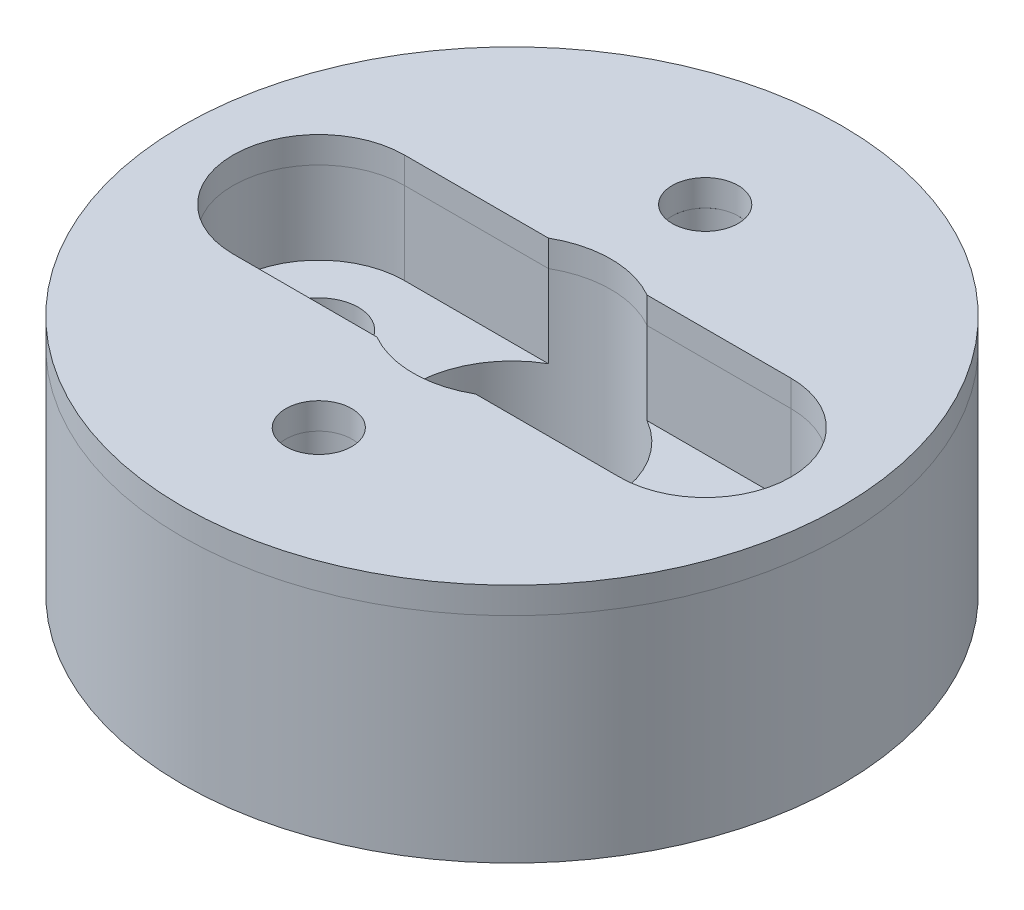
ISO-10303-21;
HEADER;
FILE_DESCRIPTION(('STEP AP214'),'2;1');
FILE_NAME('part.step','',(''),(''),'','','');
FILE_SCHEMA(('AUTOMOTIVE_DESIGN { 1 0 10303 214 1 1 1 1 }'));
ENDSEC;
DATA;
#1=APPLICATION_CONTEXT('core data for automotive mechanical design processes');
#2=APPLICATION_PROTOCOL_DEFINITION('international standard','automotive_design',2000,#1);
#3=PRODUCT_CONTEXT('',#1,'mechanical');
#4=PRODUCT('Part','Part','',(#3));
#5=PRODUCT_RELATED_PRODUCT_CATEGORY('part','',(#4));
#6=PRODUCT_DEFINITION_FORMATION('','',#4);
#7=PRODUCT_DEFINITION_CONTEXT('part definition',#1,'design');
#8=PRODUCT_DEFINITION('design','',#6,#7);
#9=PRODUCT_DEFINITION_SHAPE('','',#8);
#10=(LENGTH_UNIT() NAMED_UNIT(*) SI_UNIT(.MILLI.,.METRE.));
#11=(NAMED_UNIT(*) PLANE_ANGLE_UNIT() SI_UNIT($,.RADIAN.));
#12=(NAMED_UNIT(*) SI_UNIT($,.STERADIAN.) SOLID_ANGLE_UNIT());
#13=UNCERTAINTY_MEASURE_WITH_UNIT(LENGTH_MEASURE(1.E-05),#10,'distance_accuracy_value','');
#14=(GEOMETRIC_REPRESENTATION_CONTEXT(3) GLOBAL_UNCERTAINTY_ASSIGNED_CONTEXT((#13)) GLOBAL_UNIT_ASSIGNED_CONTEXT((#10,
#11,#12)) REPRESENTATION_CONTEXT('',''));
#15=CARTESIAN_POINT('',(0.,0.,0.));
#16=DIRECTION('',(0.,0.,1.));
#17=DIRECTION('',(1.,0.,0.));
#18=AXIS2_PLACEMENT_3D('',#15,#16,#17);
#19=CARTESIAN_POINT('',(0.,9.271,0.));
#20=DIRECTION('',(0.,1.,0.));
#21=DIRECTION('',(0.,0.,1.));
#22=AXIS2_PLACEMENT_3D('',#19,#20,#21);
#23=PLANE('',#22);
#24=CARTESIAN_POINT('',(0.,9.271,7.4422));
#25=DIRECTION('',(0.,1.,0.));
#26=DIRECTION('',(0.,0.,1.));
#27=AXIS2_PLACEMENT_3D('',#24,#25,#26);
#28=CIRCLE('',#27,1.27);
#29=CARTESIAN_POINT('',(0.,9.271,8.7122));
#30=VERTEX_POINT('',#29);
#31=EDGE_CURVE('E179',#30,#30,#28,.T.);
#32=ORIENTED_EDGE('',*,*,#31,.F.);
#33=EDGE_LOOP('',(#32));
#34=FACE_BOUND('',#33,.T.);
#35=CARTESIAN_POINT('',(0.,9.271,0.));
#36=DIRECTION('',(0.,1.,0.));
#37=DIRECTION('',(0.,0.,1.));
#38=AXIS2_PLACEMENT_3D('',#35,#36,#37);
#39=CIRCLE('',#38,12.7);
#40=CARTESIAN_POINT('',(0.,9.271,12.7));
#41=VERTEX_POINT('',#40);
#42=EDGE_CURVE('E12',#41,#41,#39,.T.);
#43=ORIENTED_EDGE('',*,*,#42,.T.);
#44=EDGE_LOOP('',(#43));
#45=FACE_BOUND('',#44,.T.);
#46=CARTESIAN_POINT('',(0.,9.271,-7.4422));
#47=DIRECTION('',(0.,1.,0.));
#48=DIRECTION('',(0.,0.,1.));
#49=AXIS2_PLACEMENT_3D('',#46,#47,#48);
#50=CIRCLE('',#49,1.27);
#51=CARTESIAN_POINT('',(0.,9.271,-6.1722));
#52=VERTEX_POINT('',#51);
#53=EDGE_CURVE('E173',#52,#52,#50,.T.);
#54=ORIENTED_EDGE('',*,*,#53,.F.);
#55=EDGE_LOOP('',(#54));
#56=FACE_BOUND('',#55,.T.);
#57=DIRECTION('',(-1.,0.,0.));
#58=VECTOR('',#57,1.);
#59=CARTESIAN_POINT('',(-1.90076195248116,9.271,-3.302));
#60=LINE('',#59,#58);
#61=CARTESIAN_POINT('',(-1.90076195248116,9.271,-3.302));
#62=VERTEX_POINT('',#61);
#63=CARTESIAN_POINT('',(-7.4422,9.271,-3.302));
#64=VERTEX_POINT('',#63);
#65=EDGE_CURVE('E116',#62,#64,#60,.T.);
#66=ORIENTED_EDGE('',*,*,#65,.F.);
#67=CARTESIAN_POINT('',(0.,9.271,0.));
#68=DIRECTION('',(0.,1.,0.));
#69=DIRECTION('',(0.,0.,1.));
#70=AXIS2_PLACEMENT_3D('',#67,#68,#69);
#71=CIRCLE('',#70,3.81);
#72=CARTESIAN_POINT('',(1.90076195248116,9.271,-3.302));
#73=VERTEX_POINT('',#72);
#74=EDGE_CURVE('E108',#73,#62,#71,.T.);
#75=ORIENTED_EDGE('',*,*,#74,.F.);
#76=DIRECTION('',(-1.,0.,0.));
#77=VECTOR('',#76,1.);
#78=CARTESIAN_POINT('',(7.4422,9.271,-3.302));
#79=LINE('',#78,#77);
#80=CARTESIAN_POINT('',(7.4422,9.271,-3.302));
#81=VERTEX_POINT('',#80);
#82=EDGE_CURVE('E141',#81,#73,#79,.T.);
#83=ORIENTED_EDGE('',*,*,#82,.F.);
#84=CARTESIAN_POINT('',(7.4422,9.271,0.));
#85=DIRECTION('',(0.,1.,0.));
#86=DIRECTION('',(0.,0.,1.));
#87=AXIS2_PLACEMENT_3D('',#84,#85,#86);
#88=CIRCLE('',#87,3.302);
#89=CARTESIAN_POINT('',(7.4422,9.271,3.302));
#90=VERTEX_POINT('',#89);
#91=EDGE_CURVE('E139',#90,#81,#88,.T.);
#92=ORIENTED_EDGE('',*,*,#91,.F.);
#93=DIRECTION('',(1.,0.,0.));
#94=VECTOR('',#93,1.);
#95=CARTESIAN_POINT('',(1.90076195248116,9.271,3.302));
#96=LINE('',#95,#94);
#97=CARTESIAN_POINT('',(1.90076195248116,9.271,3.302));
#98=VERTEX_POINT('',#97);
#99=EDGE_CURVE('E137',#98,#90,#96,.T.);
#100=ORIENTED_EDGE('',*,*,#99,.F.);
#101=CARTESIAN_POINT('',(0.,9.271,0.));
#102=DIRECTION('',(0.,1.,0.));
#103=DIRECTION('',(0.,0.,1.));
#104=AXIS2_PLACEMENT_3D('',#101,#102,#103);
#105=CIRCLE('',#104,3.81);
#106=CARTESIAN_POINT('',(-1.90076195248116,9.271,3.302));
#107=VERTEX_POINT('',#106);
#108=EDGE_CURVE('E135',#107,#98,#105,.T.);
#109=ORIENTED_EDGE('',*,*,#108,.F.);
#110=DIRECTION('',(1.,0.,0.));
#111=VECTOR('',#110,1.);
#112=CARTESIAN_POINT('',(-7.4422,9.271,3.302));
#113=LINE('',#112,#111);
#114=CARTESIAN_POINT('',(-7.4422,9.271,3.302));
#115=VERTEX_POINT('',#114);
#116=EDGE_CURVE('E131',#115,#107,#113,.T.);
#117=ORIENTED_EDGE('',*,*,#116,.F.);
#118=CARTESIAN_POINT('',(-7.4422,9.271,0.));
#119=DIRECTION('',(0.,1.,0.));
#120=DIRECTION('',(0.,0.,1.));
#121=AXIS2_PLACEMENT_3D('',#118,#119,#120);
#122=CIRCLE('',#121,3.302);
#123=EDGE_CURVE('E129',#64,#115,#122,.T.);
#124=ORIENTED_EDGE('',*,*,#123,.F.);
#125=EDGE_LOOP('',(#66,#75,#83,#92,#100,#109,#117,#124));
#126=FACE_BOUND('',#125,.T.);
#127=ADVANCED_FACE('F43',(#34,#45,#56,#126),#23,.T.);
#128=CARTESIAN_POINT('',(0.,8.255,0.));
#129=DIRECTION('',(0.,1.,0.));
#130=DIRECTION('',(0.,0.,1.));
#131=AXIS2_PLACEMENT_3D('',#128,#129,#130);
#132=PLANE('',#131);
#133=CARTESIAN_POINT('',(0.,8.255,-7.4422));
#134=DIRECTION('',(0.,1.,0.));
#135=DIRECTION('',(0.,0.,1.));
#136=AXIS2_PLACEMENT_3D('',#133,#134,#135);
#137=CIRCLE('',#136,1.27);
#138=CARTESIAN_POINT('',(0.,8.255,-6.1722));
#139=VERTEX_POINT('',#138);
#140=EDGE_CURVE('E124',#139,#139,#137,.T.);
#141=ORIENTED_EDGE('',*,*,#140,.T.);
#142=EDGE_LOOP('',(#141));
#143=FACE_BOUND('',#142,.T.);
#144=CARTESIAN_POINT('',(0.,8.255,7.4422));
#145=DIRECTION('',(0.,1.,0.));
#146=DIRECTION('',(0.,0.,1.));
#147=AXIS2_PLACEMENT_3D('',#144,#145,#146);
#148=CIRCLE('',#147,1.27);
#149=CARTESIAN_POINT('',(0.,8.255,8.7122));
#150=VERTEX_POINT('',#149);
#151=EDGE_CURVE('E176',#150,#150,#148,.T.);
#152=ORIENTED_EDGE('',*,*,#151,.T.);
#153=EDGE_LOOP('',(#152));
#154=FACE_BOUND('',#153,.T.);
#155=CARTESIAN_POINT('',(0.,8.255,0.));
#156=DIRECTION('',(0.,1.,0.));
#157=DIRECTION('',(0.,0.,1.));
#158=AXIS2_PLACEMENT_3D('',#155,#156,#157);
#159=CIRCLE('',#158,12.7);
#160=CARTESIAN_POINT('',(0.,8.255,12.7));
#161=VERTEX_POINT('',#160);
#162=EDGE_CURVE('E47',#161,#161,#159,.T.);
#163=ORIENTED_EDGE('',*,*,#162,.F.);
#164=EDGE_LOOP('',(#163));
#165=FACE_BOUND('',#164,.T.);
#166=CARTESIAN_POINT('',(0.,8.255,0.));
#167=DIRECTION('',(0.,1.,0.));
#168=DIRECTION('',(0.,0.,1.));
#169=AXIS2_PLACEMENT_3D('',#166,#167,#168);
#170=CIRCLE('',#169,3.81);
#171=CARTESIAN_POINT('',(1.90076195248116,8.255,-3.302));
#172=VERTEX_POINT('',#171);
#173=CARTESIAN_POINT('',(-1.90076195248116,8.255,-3.302));
#174=VERTEX_POINT('',#173);
#175=EDGE_CURVE('E66',#172,#174,#170,.T.);
#176=ORIENTED_EDGE('',*,*,#175,.T.);
#177=DIRECTION('',(-1.,0.,0.));
#178=VECTOR('',#177,1.);
#179=CARTESIAN_POINT('',(-1.90076195248116,8.255,-3.302));
#180=LINE('',#179,#178);
#181=CARTESIAN_POINT('',(-7.4422,8.255,-3.302));
#182=VERTEX_POINT('',#181);
#183=EDGE_CURVE('E123',#174,#182,#180,.T.);
#184=ORIENTED_EDGE('',*,*,#183,.T.);
#185=CARTESIAN_POINT('',(-7.4422,8.255,0.));
#186=DIRECTION('',(0.,1.,0.));
#187=DIRECTION('',(0.,0.,1.));
#188=AXIS2_PLACEMENT_3D('',#185,#186,#187);
#189=CIRCLE('',#188,3.302);
#190=CARTESIAN_POINT('',(-7.4422,8.255,3.302));
#191=VERTEX_POINT('',#190);
#192=EDGE_CURVE('E145',#182,#191,#189,.T.);
#193=ORIENTED_EDGE('',*,*,#192,.T.);
#194=DIRECTION('',(1.,0.,0.));
#195=VECTOR('',#194,1.);
#196=CARTESIAN_POINT('',(-7.4422,8.255,3.302));
#197=LINE('',#196,#195);
#198=CARTESIAN_POINT('',(-1.90076195248116,8.255,3.302));
#199=VERTEX_POINT('',#198);
#200=EDGE_CURVE('E148',#191,#199,#197,.T.);
#201=ORIENTED_EDGE('',*,*,#200,.T.);
#202=CARTESIAN_POINT('',(0.,8.255,0.));
#203=DIRECTION('',(0.,1.,0.));
#204=DIRECTION('',(0.,0.,1.));
#205=AXIS2_PLACEMENT_3D('',#202,#203,#204);
#206=CIRCLE('',#205,3.81);
#207=CARTESIAN_POINT('',(1.90076195248116,8.255,3.302));
#208=VERTEX_POINT('',#207);
#209=EDGE_CURVE('E151',#199,#208,#206,.T.);
#210=ORIENTED_EDGE('',*,*,#209,.T.);
#211=DIRECTION('',(1.,0.,0.));
#212=VECTOR('',#211,1.);
#213=CARTESIAN_POINT('',(1.90076195248116,8.255,3.302));
#214=LINE('',#213,#212);
#215=CARTESIAN_POINT('',(7.4422,8.255,3.302));
#216=VERTEX_POINT('',#215);
#217=EDGE_CURVE('E154',#208,#216,#214,.T.);
#218=ORIENTED_EDGE('',*,*,#217,.T.);
#219=CARTESIAN_POINT('',(7.4422,8.255,0.));
#220=DIRECTION('',(0.,1.,0.));
#221=DIRECTION('',(0.,0.,1.));
#222=AXIS2_PLACEMENT_3D('',#219,#220,#221);
#223=CIRCLE('',#222,3.302);
#224=CARTESIAN_POINT('',(7.4422,8.255,-3.302));
#225=VERTEX_POINT('',#224);
#226=EDGE_CURVE('E157',#216,#225,#223,.T.);
#227=ORIENTED_EDGE('',*,*,#226,.T.);
#228=DIRECTION('',(-1.,0.,0.));
#229=VECTOR('',#228,1.);
#230=CARTESIAN_POINT('',(7.4422,8.255,-3.302));
#231=LINE('',#230,#229);
#232=EDGE_CURVE('E117',#225,#172,#231,.T.);
#233=ORIENTED_EDGE('',*,*,#232,.T.);
#234=EDGE_LOOP('',(#176,#184,#193,#201,#210,#218,#227,#233));
#235=FACE_BOUND('',#234,.T.);
#236=ADVANCED_FACE('F185',(#143,#154,#165,#235),#132,.F.);
#237=CARTESIAN_POINT('',(0.,9.271,0.));
#238=DIRECTION('',(0.,-1.,0.));
#239=DIRECTION('',(0.,0.,-1.));
#240=AXIS2_PLACEMENT_3D('',#237,#238,#239);
#241=CYLINDRICAL_SURFACE('',#240,12.7);
#242=ORIENTED_EDGE('',*,*,#42,.F.);
#243=EDGE_LOOP('',(#242));
#244=FACE_BOUND('',#243,.T.);
#245=ORIENTED_EDGE('',*,*,#162,.T.);
#246=EDGE_LOOP('',(#245));
#247=FACE_BOUND('',#246,.T.);
#248=ADVANCED_FACE('F45',(#244,#247),#241,.T.);
#249=CARTESIAN_POINT('',(0.,9.271,7.4422));
#250=DIRECTION('',(0.,-1.,0.));
#251=DIRECTION('',(0.,0.,-1.));
#252=AXIS2_PLACEMENT_3D('',#249,#250,#251);
#253=CYLINDRICAL_SURFACE('',#252,1.27);
#254=ORIENTED_EDGE('',*,*,#31,.T.);
#255=EDGE_LOOP('',(#254));
#256=FACE_BOUND('',#255,.T.);
#257=ORIENTED_EDGE('',*,*,#151,.F.);
#258=EDGE_LOOP('',(#257));
#259=FACE_BOUND('',#258,.T.);
#260=ADVANCED_FACE('F188',(#256,#259),#253,.F.);
#261=CARTESIAN_POINT('',(0.,9.271,-7.4422));
#262=DIRECTION('',(0.,-1.,0.));
#263=DIRECTION('',(0.,0.,-1.));
#264=AXIS2_PLACEMENT_3D('',#261,#262,#263);
#265=CYLINDRICAL_SURFACE('',#264,1.27);
#266=ORIENTED_EDGE('',*,*,#53,.T.);
#267=EDGE_LOOP('',(#266));
#268=FACE_BOUND('',#267,.T.);
#269=ORIENTED_EDGE('',*,*,#140,.F.);
#270=EDGE_LOOP('',(#269));
#271=FACE_BOUND('',#270,.T.);
#272=ADVANCED_FACE('F190',(#268,#271),#265,.F.);
#273=CARTESIAN_POINT('',(0.,9.271,0.));
#274=DIRECTION('',(0.,-1.,0.));
#275=DIRECTION('',(0.,0.,-1.));
#276=AXIS2_PLACEMENT_3D('',#273,#274,#275);
#277=CYLINDRICAL_SURFACE('',#276,3.81);
#278=ORIENTED_EDGE('',*,*,#175,.F.);
#279=DIRECTION('',(0.,-1.,0.));
#280=VECTOR('',#279,1.);
#281=CARTESIAN_POINT('',(1.90076195248116,9.271,-3.302));
#282=LINE('',#281,#280);
#283=EDGE_CURVE('E112',#73,#172,#282,.T.);
#284=ORIENTED_EDGE('',*,*,#283,.F.);
#285=ORIENTED_EDGE('',*,*,#74,.T.);
#286=DIRECTION('',(0.,-1.,0.));
#287=VECTOR('',#286,1.);
#288=CARTESIAN_POINT('',(-1.90076195248116,9.271,-3.302));
#289=LINE('',#288,#287);
#290=EDGE_CURVE('E111',#62,#174,#289,.T.);
#291=ORIENTED_EDGE('',*,*,#290,.T.);
#292=EDGE_LOOP('',(#278,#284,#285,#291));
#293=FACE_BOUND('',#292,.T.);
#294=ADVANCED_FACE('F110',(#293),#277,.F.);
#295=CARTESIAN_POINT('',(-1.90076195248116,9.271,-3.302));
#296=DIRECTION('',(0.,0.,1.));
#297=DIRECTION('',(1.,0.,0.));
#298=AXIS2_PLACEMENT_3D('',#295,#296,#297);
#299=PLANE('',#298);
#300=ORIENTED_EDGE('',*,*,#183,.F.);
#301=ORIENTED_EDGE('',*,*,#290,.F.);
#302=ORIENTED_EDGE('',*,*,#65,.T.);
#303=DIRECTION('',(0.,-1.,0.));
#304=VECTOR('',#303,1.);
#305=CARTESIAN_POINT('',(-7.4422,9.271,-3.302));
#306=LINE('',#305,#304);
#307=EDGE_CURVE('E125',#64,#182,#306,.T.);
#308=ORIENTED_EDGE('',*,*,#307,.T.);
#309=EDGE_LOOP('',(#300,#301,#302,#308));
#310=FACE_BOUND('',#309,.T.);
#311=ADVANCED_FACE('F120',(#310),#299,.T.);
#312=CARTESIAN_POINT('',(-7.4422,9.271,0.));
#313=DIRECTION('',(0.,-1.,0.));
#314=DIRECTION('',(0.,0.,-1.));
#315=AXIS2_PLACEMENT_3D('',#312,#313,#314);
#316=CYLINDRICAL_SURFACE('',#315,3.302);
#317=ORIENTED_EDGE('',*,*,#192,.F.);
#318=ORIENTED_EDGE('',*,*,#307,.F.);
#319=ORIENTED_EDGE('',*,*,#123,.T.);
#320=DIRECTION('',(0.,-1.,0.));
#321=VECTOR('',#320,1.);
#322=CARTESIAN_POINT('',(-7.4422,9.271,3.302));
#323=LINE('',#322,#321);
#324=EDGE_CURVE('E170',#115,#191,#323,.T.);
#325=ORIENTED_EDGE('',*,*,#324,.T.);
#326=EDGE_LOOP('',(#317,#318,#319,#325));
#327=FACE_BOUND('',#326,.T.);
#328=ADVANCED_FACE('F240',(#327),#316,.F.);
#329=CARTESIAN_POINT('',(-7.4422,9.271,3.302));
#330=DIRECTION('',(0.,0.,-1.));
#331=DIRECTION('',(-1.,0.,0.));
#332=AXIS2_PLACEMENT_3D('',#329,#330,#331);
#333=PLANE('',#332);
#334=ORIENTED_EDGE('',*,*,#200,.F.);
#335=ORIENTED_EDGE('',*,*,#324,.F.);
#336=ORIENTED_EDGE('',*,*,#116,.T.);
#337=DIRECTION('',(0.,-1.,0.));
#338=VECTOR('',#337,1.);
#339=CARTESIAN_POINT('',(-1.90076195248116,9.271,3.302));
#340=LINE('',#339,#338);
#341=EDGE_CURVE('E168',#107,#199,#340,.T.);
#342=ORIENTED_EDGE('',*,*,#341,.T.);
#343=EDGE_LOOP('',(#334,#335,#336,#342));
#344=FACE_BOUND('',#343,.T.);
#345=ADVANCED_FACE('F237',(#344),#333,.T.);
#346=CARTESIAN_POINT('',(0.,9.271,0.));
#347=DIRECTION('',(0.,-1.,0.));
#348=DIRECTION('',(0.,0.,-1.));
#349=AXIS2_PLACEMENT_3D('',#346,#347,#348);
#350=CYLINDRICAL_SURFACE('',#349,3.81);
#351=ORIENTED_EDGE('',*,*,#209,.F.);
#352=ORIENTED_EDGE('',*,*,#341,.F.);
#353=ORIENTED_EDGE('',*,*,#108,.T.);
#354=DIRECTION('',(0.,-1.,0.));
#355=VECTOR('',#354,1.);
#356=CARTESIAN_POINT('',(1.90076195248116,9.271,3.302));
#357=LINE('',#356,#355);
#358=EDGE_CURVE('E166',#98,#208,#357,.T.);
#359=ORIENTED_EDGE('',*,*,#358,.T.);
#360=EDGE_LOOP('',(#351,#352,#353,#359));
#361=FACE_BOUND('',#360,.T.);
#362=ADVANCED_FACE('F232',(#361),#350,.F.);
#363=CARTESIAN_POINT('',(1.90076195248116,9.271,3.302));
#364=DIRECTION('',(0.,0.,-1.));
#365=DIRECTION('',(-1.,0.,0.));
#366=AXIS2_PLACEMENT_3D('',#363,#364,#365);
#367=PLANE('',#366);
#368=ORIENTED_EDGE('',*,*,#217,.F.);
#369=ORIENTED_EDGE('',*,*,#358,.F.);
#370=ORIENTED_EDGE('',*,*,#99,.T.);
#371=DIRECTION('',(0.,-1.,0.));
#372=VECTOR('',#371,1.);
#373=CARTESIAN_POINT('',(7.4422,9.271,3.302));
#374=LINE('',#373,#372);
#375=EDGE_CURVE('E164',#90,#216,#374,.T.);
#376=ORIENTED_EDGE('',*,*,#375,.T.);
#377=EDGE_LOOP('',(#368,#369,#370,#376));
#378=FACE_BOUND('',#377,.T.);
#379=ADVANCED_FACE('F228',(#378),#367,.T.);
#380=CARTESIAN_POINT('',(7.4422,9.271,0.));
#381=DIRECTION('',(0.,-1.,0.));
#382=DIRECTION('',(0.,0.,-1.));
#383=AXIS2_PLACEMENT_3D('',#380,#381,#382);
#384=CYLINDRICAL_SURFACE('',#383,3.302);
#385=ORIENTED_EDGE('',*,*,#226,.F.);
#386=ORIENTED_EDGE('',*,*,#375,.F.);
#387=ORIENTED_EDGE('',*,*,#91,.T.);
#388=DIRECTION('',(0.,-1.,0.));
#389=VECTOR('',#388,1.);
#390=CARTESIAN_POINT('',(7.4422,9.271,-3.302));
#391=LINE('',#390,#389);
#392=EDGE_CURVE('E58',#81,#225,#391,.T.);
#393=ORIENTED_EDGE('',*,*,#392,.T.);
#394=EDGE_LOOP('',(#385,#386,#387,#393));
#395=FACE_BOUND('',#394,.T.);
#396=ADVANCED_FACE('F225',(#395),#384,.F.);
#397=CARTESIAN_POINT('',(7.4422,9.271,-3.302));
#398=DIRECTION('',(0.,0.,1.));
#399=DIRECTION('',(1.,0.,0.));
#400=AXIS2_PLACEMENT_3D('',#397,#398,#399);
#401=PLANE('',#400);
#402=ORIENTED_EDGE('',*,*,#232,.F.);
#403=ORIENTED_EDGE('',*,*,#392,.F.);
#404=ORIENTED_EDGE('',*,*,#82,.T.);
#405=ORIENTED_EDGE('',*,*,#283,.T.);
#406=EDGE_LOOP('',(#402,#403,#404,#405));
#407=FACE_BOUND('',#406,.T.);
#408=ADVANCED_FACE('F219',(#407),#401,.T.);
#409=CLOSED_SHELL('',(#127,#236,#248,#260,#272,#294,#311,#328,#345,#362,#379,#396,#408));
#410=MANIFOLD_SOLID_BREP('B2',#409);
#411=CARTESIAN_POINT('',(-7.4422,5.08,0.));
#412=DIRECTION('',(0.,1.,0.));
#413=DIRECTION('',(0.,0.,1.));
#414=AXIS2_PLACEMENT_3D('',#411,#412,#413);
#415=CYLINDRICAL_SURFACE('',#414,3.302);
#416=DIRECTION('',(0.,1.,0.));
#417=VECTOR('',#416,1.);
#418=CARTESIAN_POINT('',(-7.4422,-17.4003058377772,-3.302));
#419=LINE('',#418,#417);
#420=CARTESIAN_POINT('',(-7.4422,5.08,-3.302));
#421=VERTEX_POINT('',#420);
#422=CARTESIAN_POINT('',(-7.4422,8.255,-3.302));
#423=VERTEX_POINT('',#422);
#424=EDGE_CURVE('E424',#421,#423,#419,.T.);
#425=ORIENTED_EDGE('',*,*,#424,.T.);
#426=CARTESIAN_POINT('',(-7.4422,8.255,0.));
#427=DIRECTION('',(0.,1.,0.));
#428=DIRECTION('',(0.,0.,1.));
#429=AXIS2_PLACEMENT_3D('',#426,#427,#428);
#430=CIRCLE('',#429,3.302);
#431=CARTESIAN_POINT('',(-7.4422,8.255,3.302));
#432=VERTEX_POINT('',#431);
#433=EDGE_CURVE('E415',#423,#432,#430,.T.);
#434=ORIENTED_EDGE('',*,*,#433,.T.);
#435=DIRECTION('',(0.,1.,0.));
#436=VECTOR('',#435,1.);
#437=CARTESIAN_POINT('',(-7.4422,-17.4003058377772,3.302));
#438=LINE('',#437,#436);
#439=CARTESIAN_POINT('',(-7.4422,5.08,3.302));
#440=VERTEX_POINT('',#439);
#441=EDGE_CURVE('E397',#440,#432,#438,.T.);
#442=ORIENTED_EDGE('',*,*,#441,.F.);
#443=CARTESIAN_POINT('',(-7.4422,5.08,0.));
#444=DIRECTION('',(0.,1.,0.));
#445=DIRECTION('',(0.,0.,1.));
#446=AXIS2_PLACEMENT_3D('',#443,#444,#445);
#447=CIRCLE('',#446,3.302);
#448=EDGE_CURVE('E425',#421,#440,#447,.T.);
#449=ORIENTED_EDGE('',*,*,#448,.F.);
#450=EDGE_LOOP('',(#425,#434,#442,#449));
#451=FACE_BOUND('',#450,.T.);
#452=ADVANCED_FACE('F333',(#451),#415,.F.);
#453=CARTESIAN_POINT('',(7.4422,8.255,0.));
#454=DIRECTION('',(0.,-1.,0.));
#455=DIRECTION('',(0.,0.,-1.));
#456=AXIS2_PLACEMENT_3D('',#453,#454,#455);
#457=CYLINDRICAL_SURFACE('',#456,1.524);
#458=CARTESIAN_POINT('',(7.4422,0.,0.));
#459=DIRECTION('',(0.,1.,0.));
#460=DIRECTION('',(0.,0.,1.));
#461=AXIS2_PLACEMENT_3D('',#458,#459,#460);
#462=CIRCLE('',#461,1.524);
#463=CARTESIAN_POINT('',(7.4422,0.,1.524));
#464=VERTEX_POINT('',#463);
#465=EDGE_CURVE('E440',#464,#464,#462,.T.);
#466=ORIENTED_EDGE('',*,*,#465,.F.);
#467=EDGE_LOOP('',(#466));
#468=FACE_BOUND('',#467,.T.);
#469=CARTESIAN_POINT('',(7.4422,5.08,0.));
#470=DIRECTION('',(0.,1.,0.));
#471=DIRECTION('',(0.,0.,1.));
#472=AXIS2_PLACEMENT_3D('',#469,#470,#471);
#473=CIRCLE('',#472,1.524);
#474=CARTESIAN_POINT('',(7.4422,5.08,1.524));
#475=VERTEX_POINT('',#474);
#476=EDGE_CURVE('E441',#475,#475,#473,.T.);
#477=ORIENTED_EDGE('',*,*,#476,.T.);
#478=EDGE_LOOP('',(#477));
#479=FACE_BOUND('',#478,.T.);
#480=ADVANCED_FACE('F516',(#468,#479),#457,.F.);
#481=CARTESIAN_POINT('',(-7.4422,8.255,0.));
#482=DIRECTION('',(0.,-1.,0.));
#483=DIRECTION('',(0.,0.,-1.));
#484=AXIS2_PLACEMENT_3D('',#481,#482,#483);
#485=CYLINDRICAL_SURFACE('',#484,1.524);
#486=CARTESIAN_POINT('',(-7.4422,0.,0.));
#487=DIRECTION('',(0.,1.,0.));
#488=DIRECTION('',(0.,0.,-1.));
#489=AXIS2_PLACEMENT_3D('',#486,#487,#488);
#490=CIRCLE('',#489,1.524);
#491=CARTESIAN_POINT('',(-7.4422,0.,-1.524));
#492=VERTEX_POINT('',#491);
#493=EDGE_CURVE('E437',#492,#492,#490,.T.);
#494=ORIENTED_EDGE('',*,*,#493,.F.);
#495=EDGE_LOOP('',(#494));
#496=FACE_BOUND('',#495,.T.);
#497=CARTESIAN_POINT('',(-7.4422,5.08,0.));
#498=DIRECTION('',(0.,1.,0.));
#499=DIRECTION('',(0.,0.,1.));
#500=AXIS2_PLACEMENT_3D('',#497,#498,#499);
#501=CIRCLE('',#500,1.524);
#502=CARTESIAN_POINT('',(-7.4422,5.08,1.524));
#503=VERTEX_POINT('',#502);
#504=EDGE_CURVE('E428',#503,#503,#501,.T.);
#505=ORIENTED_EDGE('',*,*,#504,.T.);
#506=EDGE_LOOP('',(#505));
#507=FACE_BOUND('',#506,.T.);
#508=ADVANCED_FACE('F499',(#496,#507),#485,.F.);
#509=CARTESIAN_POINT('',(0.,8.255,0.));
#510=DIRECTION('',(0.,1.,0.));
#511=DIRECTION('',(0.,0.,1.));
#512=AXIS2_PLACEMENT_3D('',#509,#510,#511);
#513=PLANE('',#512);
#514=DIRECTION('',(-1.,0.,0.));
#515=VECTOR('',#514,1.);
#516=CARTESIAN_POINT('',(-7.4422,8.255,-3.302));
#517=LINE('',#516,#515);
#518=CARTESIAN_POINT('',(7.4422,8.255,-3.302));
#519=VERTEX_POINT('',#518);
#520=CARTESIAN_POINT('',(1.90076195248116,8.255,-3.302));
#521=VERTEX_POINT('',#520);
#522=EDGE_CURVE('E406',#519,#521,#517,.T.);
#523=ORIENTED_EDGE('',*,*,#522,.F.);
#524=CARTESIAN_POINT('',(7.4422,8.255,0.));
#525=DIRECTION('',(0.,1.,0.));
#526=DIRECTION('',(0.,0.,1.));
#527=AXIS2_PLACEMENT_3D('',#524,#525,#526);
#528=CIRCLE('',#527,3.302);
#529=CARTESIAN_POINT('',(7.4422,8.255,3.302));
#530=VERTEX_POINT('',#529);
#531=EDGE_CURVE('E430',#530,#519,#528,.T.);
#532=ORIENTED_EDGE('',*,*,#531,.F.);
#533=DIRECTION('',(1.,0.,0.));
#534=VECTOR('',#533,1.);
#535=CARTESIAN_POINT('',(-7.4422,8.255,3.302));
#536=LINE('',#535,#534);
#537=CARTESIAN_POINT('',(1.90076195248116,8.255,3.302));
#538=VERTEX_POINT('',#537);
#539=EDGE_CURVE('E420',#538,#530,#536,.T.);
#540=ORIENTED_EDGE('',*,*,#539,.F.);
#541=CARTESIAN_POINT('',(0.,8.255,0.));
#542=DIRECTION('',(0.,1.,0.));
#543=DIRECTION('',(0.,0.,1.));
#544=AXIS2_PLACEMENT_3D('',#541,#542,#543);
#545=CIRCLE('',#544,3.81);
#546=CARTESIAN_POINT('',(-1.90076195248116,8.255,3.302));
#547=VERTEX_POINT('',#546);
#548=EDGE_CURVE('E418',#547,#538,#545,.T.);
#549=ORIENTED_EDGE('',*,*,#548,.F.);
#550=EDGE_CURVE('E400',#432,#547,#536,.T.);
#551=ORIENTED_EDGE('',*,*,#550,.F.);
#552=ORIENTED_EDGE('',*,*,#433,.F.);
#553=CARTESIAN_POINT('',(-1.90076195248116,8.255,-3.302));
#554=VERTEX_POINT('',#553);
#555=EDGE_CURVE('E419',#554,#423,#517,.T.);
#556=ORIENTED_EDGE('',*,*,#555,.F.);
#557=EDGE_CURVE('E474',#521,#554,#545,.T.);
#558=ORIENTED_EDGE('',*,*,#557,.F.);
#559=EDGE_LOOP('',(#523,#532,#540,#549,#551,#552,#556,#558));
#560=FACE_BOUND('',#559,.T.);
#561=CARTESIAN_POINT('',(0.,8.255,7.4422));
#562=DIRECTION('',(0.,1.,0.));
#563=DIRECTION('',(0.,0.,1.));
#564=AXIS2_PLACEMENT_3D('',#561,#562,#563);
#565=CIRCLE('',#564,1.27);
#566=CARTESIAN_POINT('',(0.,8.255,8.7122));
#567=VERTEX_POINT('',#566);
#568=EDGE_CURVE('E486',#567,#567,#565,.T.);
#569=ORIENTED_EDGE('',*,*,#568,.F.);
#570=EDGE_LOOP('',(#569));
#571=FACE_BOUND('',#570,.T.);
#572=CARTESIAN_POINT('',(0.,8.255,-7.4422));
#573=DIRECTION('',(0.,1.,0.));
#574=DIRECTION('',(0.,0.,-1.));
#575=AXIS2_PLACEMENT_3D('',#572,#573,#574);
#576=CIRCLE('',#575,1.27);
#577=CARTESIAN_POINT('',(0.,8.255,-8.7122));
#578=VERTEX_POINT('',#577);
#579=EDGE_CURVE('E479',#578,#578,#576,.T.);
#580=ORIENTED_EDGE('',*,*,#579,.F.);
#581=EDGE_LOOP('',(#580));
#582=FACE_BOUND('',#581,.T.);
#583=CARTESIAN_POINT('',(0.,8.255,0.));
#584=DIRECTION('',(0.,1.,0.));
#585=DIRECTION('',(0.,0.,1.));
#586=AXIS2_PLACEMENT_3D('',#583,#584,#585);
#587=CIRCLE('',#586,12.7);
#588=CARTESIAN_POINT('',(0.,8.255,12.7));
#589=VERTEX_POINT('',#588);
#590=EDGE_CURVE('E445',#589,#589,#587,.T.);
#591=ORIENTED_EDGE('',*,*,#590,.T.);
#592=EDGE_LOOP('',(#591));
#593=FACE_BOUND('',#592,.T.);
#594=ADVANCED_FACE('F412',(#560,#571,#582,#593),#513,.T.);
#595=CARTESIAN_POINT('',(0.,0.,0.));
#596=DIRECTION('',(0.,1.,0.));
#597=DIRECTION('',(0.,0.,1.));
#598=AXIS2_PLACEMENT_3D('',#595,#596,#597);
#599=PLANE('',#598);
#600=CARTESIAN_POINT('',(0.,0.,0.));
#601=DIRECTION('',(0.,1.,0.));
#602=DIRECTION('',(0.,0.,1.));
#603=AXIS2_PLACEMENT_3D('',#600,#601,#602);
#604=CIRCLE('',#603,3.81);
#605=CARTESIAN_POINT('',(0.,0.,3.81));
#606=VERTEX_POINT('',#605);
#607=EDGE_CURVE('E476',#606,#606,#604,.T.);
#608=ORIENTED_EDGE('',*,*,#607,.T.);
#609=EDGE_LOOP('',(#608));
#610=FACE_BOUND('',#609,.T.);
#611=CARTESIAN_POINT('',(0.,0.,7.4422));
#612=DIRECTION('',(0.,1.,0.));
#613=DIRECTION('',(0.,0.,1.));
#614=AXIS2_PLACEMENT_3D('',#611,#612,#613);
#615=CIRCLE('',#614,1.27);
#616=CARTESIAN_POINT('',(0.,0.,8.7122));
#617=VERTEX_POINT('',#616);
#618=EDGE_CURVE('E436',#617,#617,#615,.T.);
#619=ORIENTED_EDGE('',*,*,#618,.T.);
#620=EDGE_LOOP('',(#619));
#621=FACE_BOUND('',#620,.T.);
#622=CARTESIAN_POINT('',(0.,0.,-7.4422));
#623=DIRECTION('',(0.,1.,0.));
#624=DIRECTION('',(0.,0.,-1.));
#625=AXIS2_PLACEMENT_3D('',#622,#623,#624);
#626=CIRCLE('',#625,1.27);
#627=CARTESIAN_POINT('',(0.,0.,-8.7122));
#628=VERTEX_POINT('',#627);
#629=EDGE_CURVE('E489',#628,#628,#626,.T.);
#630=ORIENTED_EDGE('',*,*,#629,.T.);
#631=EDGE_LOOP('',(#630));
#632=FACE_BOUND('',#631,.T.);
#633=CARTESIAN_POINT('',(0.,0.,0.));
#634=DIRECTION('',(0.,1.,0.));
#635=DIRECTION('',(0.,0.,1.));
#636=AXIS2_PLACEMENT_3D('',#633,#634,#635);
#637=CIRCLE('',#636,12.7);
#638=CARTESIAN_POINT('',(0.,0.,12.7));
#639=VERTEX_POINT('',#638);
#640=EDGE_CURVE('E444',#639,#639,#637,.T.);
#641=ORIENTED_EDGE('',*,*,#640,.F.);
#642=EDGE_LOOP('',(#641));
#643=FACE_BOUND('',#642,.T.);
#644=ORIENTED_EDGE('',*,*,#465,.T.);
#645=EDGE_LOOP('',(#644));
#646=FACE_BOUND('',#645,.T.);
#647=ORIENTED_EDGE('',*,*,#493,.T.);
#648=EDGE_LOOP('',(#647));
#649=FACE_BOUND('',#648,.T.);
#650=ADVANCED_FACE('F498',(#610,#621,#632,#643,#646,#649),#599,.F.);
#651=CARTESIAN_POINT('',(0.,8.255,0.));
#652=DIRECTION('',(0.,-1.,0.));
#653=DIRECTION('',(0.,0.,-1.));
#654=AXIS2_PLACEMENT_3D('',#651,#652,#653);
#655=CYLINDRICAL_SURFACE('',#654,12.7);
#656=ORIENTED_EDGE('',*,*,#590,.F.);
#657=EDGE_LOOP('',(#656));
#658=FACE_BOUND('',#657,.T.);
#659=ORIENTED_EDGE('',*,*,#640,.T.);
#660=EDGE_LOOP('',(#659));
#661=FACE_BOUND('',#660,.T.);
#662=ADVANCED_FACE('F335',(#658,#661),#655,.T.);
#663=CARTESIAN_POINT('',(-7.4422,5.08,0.));
#664=DIRECTION('',(0.,1.,0.));
#665=DIRECTION('',(0.,0.,1.));
#666=AXIS2_PLACEMENT_3D('',#663,#664,#665);
#667=PLANE('',#666);
#668=ORIENTED_EDGE('',*,*,#504,.F.);
#669=EDGE_LOOP('',(#668));
#670=FACE_BOUND('',#669,.T.);
#671=ORIENTED_EDGE('',*,*,#448,.T.);
#672=DIRECTION('',(-1.,0.,0.));
#673=VECTOR('',#672,1.);
#674=CARTESIAN_POINT('',(-7.4422,5.08,3.302));
#675=LINE('',#674,#673);
#676=CARTESIAN_POINT('',(-1.90076195248116,5.08,3.302));
#677=VERTEX_POINT('',#676);
#678=EDGE_CURVE('E348',#677,#440,#675,.T.);
#679=ORIENTED_EDGE('',*,*,#678,.F.);
#680=CARTESIAN_POINT('',(0.,5.08,0.));
#681=DIRECTION('',(0.,1.,0.));
#682=DIRECTION('',(0.,0.,1.));
#683=AXIS2_PLACEMENT_3D('',#680,#681,#682);
#684=CIRCLE('',#683,3.81);
#685=CARTESIAN_POINT('',(-1.90076195248116,5.08,-3.302));
#686=VERTEX_POINT('',#685);
#687=EDGE_CURVE('E457',#677,#686,#684,.F.);
#688=ORIENTED_EDGE('',*,*,#687,.T.);
#689=DIRECTION('',(1.,0.,0.));
#690=VECTOR('',#689,1.);
#691=CARTESIAN_POINT('',(-7.4422,5.08,-3.302));
#692=LINE('',#691,#690);
#693=EDGE_CURVE('E466',#421,#686,#692,.T.);
#694=ORIENTED_EDGE('',*,*,#693,.F.);
#695=EDGE_LOOP('',(#671,#679,#688,#694));
#696=FACE_BOUND('',#695,.T.);
#697=ADVANCED_FACE('F465',(#670,#696),#667,.T.);
#698=CARTESIAN_POINT('',(7.4422,5.08,0.));
#699=DIRECTION('',(0.,1.,0.));
#700=DIRECTION('',(0.,0.,1.));
#701=AXIS2_PLACEMENT_3D('',#698,#699,#700);
#702=CYLINDRICAL_SURFACE('',#701,3.302);
#703=ORIENTED_EDGE('',*,*,#531,.T.);
#704=DIRECTION('',(0.,1.,0.));
#705=VECTOR('',#704,1.);
#706=CARTESIAN_POINT('',(7.4422,-17.4003058377772,-3.302));
#707=LINE('',#706,#705);
#708=CARTESIAN_POINT('',(7.4422,5.08,-3.302));
#709=VERTEX_POINT('',#708);
#710=EDGE_CURVE('E552',#709,#519,#707,.T.);
#711=ORIENTED_EDGE('',*,*,#710,.F.);
#712=CARTESIAN_POINT('',(7.4422,5.08,0.));
#713=DIRECTION('',(0.,1.,0.));
#714=DIRECTION('',(0.,0.,1.));
#715=AXIS2_PLACEMENT_3D('',#712,#713,#714);
#716=CIRCLE('',#715,3.302);
#717=CARTESIAN_POINT('',(7.4422,5.08,3.302));
#718=VERTEX_POINT('',#717);
#719=EDGE_CURVE('E426',#718,#709,#716,.T.);
#720=ORIENTED_EDGE('',*,*,#719,.F.);
#721=DIRECTION('',(0.,1.,0.));
#722=VECTOR('',#721,1.);
#723=CARTESIAN_POINT('',(7.4422,-17.4003058377772,3.302));
#724=LINE('',#723,#722);
#725=EDGE_CURVE('E405',#718,#530,#724,.T.);
#726=ORIENTED_EDGE('',*,*,#725,.T.);
#727=EDGE_LOOP('',(#703,#711,#720,#726));
#728=FACE_BOUND('',#727,.T.);
#729=ADVANCED_FACE('F521',(#728),#702,.F.);
#730=CARTESIAN_POINT('',(7.4422,5.08,0.));
#731=DIRECTION('',(0.,1.,0.));
#732=DIRECTION('',(0.,0.,1.));
#733=AXIS2_PLACEMENT_3D('',#730,#731,#732);
#734=PLANE('',#733);
#735=ORIENTED_EDGE('',*,*,#476,.F.);
#736=EDGE_LOOP('',(#735));
#737=FACE_BOUND('',#736,.T.);
#738=ORIENTED_EDGE('',*,*,#719,.T.);
#739=CARTESIAN_POINT('',(1.90076195248116,5.08,-3.302));
#740=VERTEX_POINT('',#739);
#741=EDGE_CURVE('E356',#740,#709,#692,.T.);
#742=ORIENTED_EDGE('',*,*,#741,.F.);
#743=CARTESIAN_POINT('',(1.90076195248116,5.08,3.302));
#744=VERTEX_POINT('',#743);
#745=EDGE_CURVE('E448',#740,#744,#684,.F.);
#746=ORIENTED_EDGE('',*,*,#745,.T.);
#747=EDGE_CURVE('E481',#718,#744,#675,.T.);
#748=ORIENTED_EDGE('',*,*,#747,.F.);
#749=EDGE_LOOP('',(#738,#742,#746,#748));
#750=FACE_BOUND('',#749,.T.);
#751=ADVANCED_FACE('F526',(#737,#750),#734,.T.);
#752=CARTESIAN_POINT('',(0.,0.,-7.4422));
#753=DIRECTION('',(0.,1.,0.));
#754=DIRECTION('',(0.,0.,1.));
#755=AXIS2_PLACEMENT_3D('',#752,#753,#754);
#756=CYLINDRICAL_SURFACE('',#755,1.27);
#757=ORIENTED_EDGE('',*,*,#629,.F.);
#758=EDGE_LOOP('',(#757));
#759=FACE_BOUND('',#758,.T.);
#760=ORIENTED_EDGE('',*,*,#579,.T.);
#761=EDGE_LOOP('',(#760));
#762=FACE_BOUND('',#761,.T.);
#763=ADVANCED_FACE('F494',(#759,#762),#756,.F.);
#764=CARTESIAN_POINT('',(0.,0.,7.4422));
#765=DIRECTION('',(0.,1.,0.));
#766=DIRECTION('',(0.,0.,1.));
#767=AXIS2_PLACEMENT_3D('',#764,#765,#766);
#768=CYLINDRICAL_SURFACE('',#767,1.27);
#769=ORIENTED_EDGE('',*,*,#618,.F.);
#770=EDGE_LOOP('',(#769));
#771=FACE_BOUND('',#770,.T.);
#772=ORIENTED_EDGE('',*,*,#568,.T.);
#773=EDGE_LOOP('',(#772));
#774=FACE_BOUND('',#773,.T.);
#775=ADVANCED_FACE('F543',(#771,#774),#768,.F.);
#776=CARTESIAN_POINT('',(0.,0.,0.));
#777=DIRECTION('',(0.,1.,0.));
#778=DIRECTION('',(0.,0.,1.));
#779=AXIS2_PLACEMENT_3D('',#776,#777,#778);
#780=CYLINDRICAL_SURFACE('',#779,3.81);
#781=ORIENTED_EDGE('',*,*,#557,.T.);
#782=DIRECTION('',(0.,1.,0.));
#783=VECTOR('',#782,1.);
#784=CARTESIAN_POINT('',(-1.90076195248116,0.,-3.302));
#785=LINE('',#784,#783);
#786=EDGE_CURVE('E41',#554,#686,#785,.F.);
#787=ORIENTED_EDGE('',*,*,#786,.T.);
#788=ORIENTED_EDGE('',*,*,#687,.F.);
#789=DIRECTION('',(0.,1.,0.));
#790=VECTOR('',#789,1.);
#791=CARTESIAN_POINT('',(-1.90076195248116,0.,3.302));
#792=LINE('',#791,#790);
#793=EDGE_CURVE('E341',#677,#547,#792,.T.);
#794=ORIENTED_EDGE('',*,*,#793,.T.);
#795=ORIENTED_EDGE('',*,*,#548,.T.);
#796=DIRECTION('',(0.,1.,0.));
#797=VECTOR('',#796,1.);
#798=CARTESIAN_POINT('',(1.90076195248116,0.,3.302));
#799=LINE('',#798,#797);
#800=EDGE_CURVE('E456',#538,#744,#799,.F.);
#801=ORIENTED_EDGE('',*,*,#800,.T.);
#802=ORIENTED_EDGE('',*,*,#745,.F.);
#803=DIRECTION('',(0.,1.,0.));
#804=VECTOR('',#803,1.);
#805=CARTESIAN_POINT('',(1.90076195248116,0.,-3.302));
#806=LINE('',#805,#804);
#807=EDGE_CURVE('E460',#740,#521,#806,.T.);
#808=ORIENTED_EDGE('',*,*,#807,.T.);
#809=EDGE_LOOP('',(#781,#787,#788,#794,#795,#801,#802,#808));
#810=FACE_BOUND('',#809,.T.);
#811=ORIENTED_EDGE('',*,*,#607,.F.);
#812=EDGE_LOOP('',(#811));
#813=FACE_BOUND('',#812,.T.);
#814=ADVANCED_FACE('F471',(#810,#813),#780,.F.);
#815=CARTESIAN_POINT('',(-7.4422,-17.4003058377772,3.302));
#816=DIRECTION('',(0.,0.,1.));
#817=DIRECTION('',(1.,0.,0.));
#818=AXIS2_PLACEMENT_3D('',#815,#816,#817);
#819=PLANE('',#818);
#820=ORIENTED_EDGE('',*,*,#539,.T.);
#821=ORIENTED_EDGE('',*,*,#725,.F.);
#822=ORIENTED_EDGE('',*,*,#747,.T.);
#823=ORIENTED_EDGE('',*,*,#800,.F.);
#824=EDGE_LOOP('',(#820,#821,#822,#823));
#825=FACE_BOUND('',#824,.T.);
#826=ADVANCED_FACE('F559',(#825),#819,.F.);
#827=CARTESIAN_POINT('',(-7.4422,-17.4003058377772,-3.302));
#828=DIRECTION('',(0.,0.,-1.));
#829=DIRECTION('',(-1.,0.,0.));
#830=AXIS2_PLACEMENT_3D('',#827,#828,#829);
#831=PLANE('',#830);
#832=ORIENTED_EDGE('',*,*,#741,.T.);
#833=ORIENTED_EDGE('',*,*,#710,.T.);
#834=ORIENTED_EDGE('',*,*,#522,.T.);
#835=ORIENTED_EDGE('',*,*,#807,.F.);
#836=EDGE_LOOP('',(#832,#833,#834,#835));
#837=FACE_BOUND('',#836,.T.);
#838=ADVANCED_FACE('F560',(#837),#831,.F.);
#839=ORIENTED_EDGE('',*,*,#555,.T.);
#840=ORIENTED_EDGE('',*,*,#424,.F.);
#841=ORIENTED_EDGE('',*,*,#693,.T.);
#842=ORIENTED_EDGE('',*,*,#786,.F.);
#843=EDGE_LOOP('',(#839,#840,#841,#842));
#844=FACE_BOUND('',#843,.T.);
#845=ADVANCED_FACE('F468',(#844),#831,.F.);
#846=ORIENTED_EDGE('',*,*,#678,.T.);
#847=ORIENTED_EDGE('',*,*,#441,.T.);
#848=ORIENTED_EDGE('',*,*,#550,.T.);
#849=ORIENTED_EDGE('',*,*,#793,.F.);
#850=EDGE_LOOP('',(#846,#847,#848,#849));
#851=FACE_BOUND('',#850,.T.);
#852=ADVANCED_FACE('F399',(#851),#819,.F.);
#853=CLOSED_SHELL('',(#452,#480,#508,#594,#650,#662,#697,#729,#751,#763,#775,#814,#826,#838,
#845,#852));
#854=MANIFOLD_SOLID_BREP('B6',#853);
#855=ADVANCED_BREP_SHAPE_REPRESENTATION('',(#18,#410,#854),#14);
#856=SHAPE_DEFINITION_REPRESENTATION(#9,#855);
ENDSEC;
END-ISO-10303-21;
